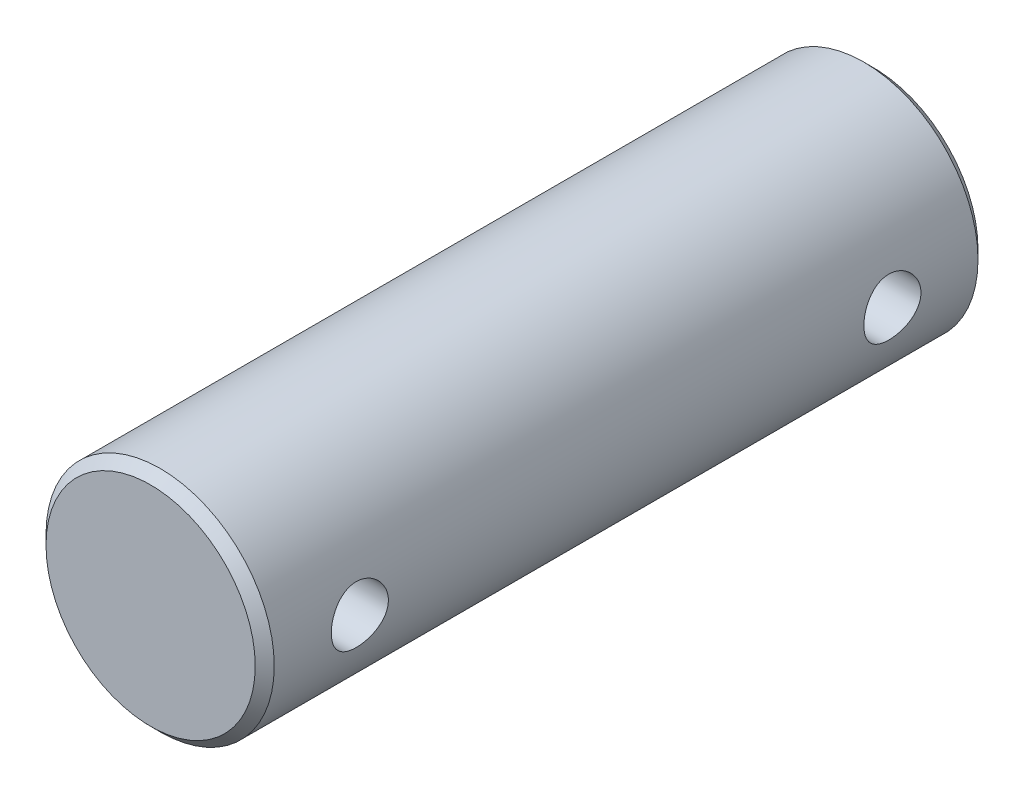
ISO-10303-21;
HEADER;
FILE_DESCRIPTION(('STEP AP214'),'2;1');
FILE_NAME('part.step','',(''),(''),'','','');
FILE_SCHEMA(('AUTOMOTIVE_DESIGN { 1 0 10303 214 1 1 1 1 }'));
ENDSEC;
DATA;
#1=APPLICATION_CONTEXT('core data for automotive mechanical design processes');
#2=APPLICATION_PROTOCOL_DEFINITION('international standard','automotive_design',2000,#1);
#3=PRODUCT_CONTEXT('',#1,'mechanical');
#4=PRODUCT('Part','Part','',(#3));
#5=PRODUCT_RELATED_PRODUCT_CATEGORY('part','',(#4));
#6=PRODUCT_DEFINITION_FORMATION('','',#4);
#7=PRODUCT_DEFINITION_CONTEXT('part definition',#1,'design');
#8=PRODUCT_DEFINITION('design','',#6,#7);
#9=PRODUCT_DEFINITION_SHAPE('','',#8);
#10=(LENGTH_UNIT() NAMED_UNIT(*) SI_UNIT(.MILLI.,.METRE.));
#11=(NAMED_UNIT(*) PLANE_ANGLE_UNIT() SI_UNIT($,.RADIAN.));
#12=(NAMED_UNIT(*) SI_UNIT($,.STERADIAN.) SOLID_ANGLE_UNIT());
#13=UNCERTAINTY_MEASURE_WITH_UNIT(LENGTH_MEASURE(1.E-05),#10,'distance_accuracy_value','');
#14=(GEOMETRIC_REPRESENTATION_CONTEXT(3) GLOBAL_UNCERTAINTY_ASSIGNED_CONTEXT((#13)) GLOBAL_UNIT_ASSIGNED_CONTEXT((#10,
#11,#12)) REPRESENTATION_CONTEXT('',''));
#15=CARTESIAN_POINT('',(0.,0.,0.));
#16=DIRECTION('',(0.,0.,1.));
#17=DIRECTION('',(1.,0.,0.));
#18=AXIS2_PLACEMENT_3D('',#15,#16,#17);
#19=CARTESIAN_POINT('',(0.,0.,19.));
#20=DIRECTION('',(0.,0.,-1.));
#21=DIRECTION('',(-1.,0.,0.));
#22=AXIS2_PLACEMENT_3D('',#19,#20,#21);
#23=CYLINDRICAL_SURFACE('',#22,6.);
#24=CARTESIAN_POINT('',(0.,0.,-18.5));
#25=DIRECTION('',(0.,0.,1.));
#26=DIRECTION('',(1.,0.,0.));
#27=AXIS2_PLACEMENT_3D('',#24,#25,#26);
#28=CIRCLE('',#27,6.);
#29=CARTESIAN_POINT('',(6.,0.,-18.5));
#30=VERTEX_POINT('',#29);
#31=EDGE_CURVE('E71',#30,#30,#28,.T.);
#32=ORIENTED_EDGE('',*,*,#31,.T.);
#33=EDGE_LOOP('',(#32));
#34=FACE_BOUND('',#33,.T.);
#35=CARTESIAN_POINT('',(0.,0.,18.5));
#36=DIRECTION('',(0.,0.,1.));
#37=DIRECTION('',(1.,0.,0.));
#38=AXIS2_PLACEMENT_3D('',#35,#36,#37);
#39=CIRCLE('',#38,6.);
#40=CARTESIAN_POINT('',(6.,0.,18.5));
#41=VERTEX_POINT('',#40);
#42=EDGE_CURVE('E77',#41,#41,#39,.F.);
#43=ORIENTED_EDGE('',*,*,#42,.T.);
#44=EDGE_LOOP('',(#43));
#45=FACE_BOUND('',#44,.T.);
#46=CARTESIAN_POINT('',(-6.,0.,12.5));
#47=CARTESIAN_POINT('',(-5.99999859868013,0.0828760886697312,12.5000023257382));
#48=CARTESIAN_POINT('',(-5.99826578131828,0.165778157830763,12.5068915507738));
#49=CARTESIAN_POINT('',(-5.99152113829892,0.329206323770533,12.534225151307));
#50=CARTESIAN_POINT('',(-5.98650745419968,0.409731046870739,12.5546772095378));
#51=CARTESIAN_POINT('',(-5.9737562633204,0.566020872182577,12.6084392534621));
#52=CARTESIAN_POINT('',(-5.96602202842087,0.641791563430003,12.6417337987153));
#53=CARTESIAN_POINT('',(-5.94865343807593,0.786672131904427,12.7201813900448));
#54=CARTESIAN_POINT('',(-5.9390190185405,0.85578178434876,12.7653348361189));
#55=CARTESIAN_POINT('',(-5.91867413591801,0.98680192730092,12.8672007896542));
#56=CARTESIAN_POINT('',(-5.90794707148533,1.04855569006107,12.9241115749592));
#57=CARTESIAN_POINT('',(-5.8867362011753,1.1617489272033,13.0474522049089));
#58=CARTESIAN_POINT('',(-5.87625242288348,1.21318723694914,13.1138831229465));
#59=CARTESIAN_POINT('',(-5.8565477569971,1.30502654279903,13.2555952267374));
#60=CARTESIAN_POINT('',(-5.84734794470605,1.34525221592536,13.3309932308104));
#61=CARTESIAN_POINT('',(-5.83149494812223,1.41239690855053,13.4877484116584));
#62=CARTESIAN_POINT('',(-5.82484135672789,1.43931805543933,13.5691046333258));
#63=CARTESIAN_POINT('',(-5.81500476717551,1.47855483680429,13.7337434982025));
#64=CARTESIAN_POINT('',(-5.81175491075426,1.49115226833334,13.8169548960498));
#65=CARTESIAN_POINT('',(-5.80889362537741,1.50226177506785,13.984368569014));
#66=CARTESIAN_POINT('',(-5.80928160448644,1.50077614181798,14.0685706806986));
#67=CARTESIAN_POINT('',(-5.81359205496618,1.48398652463928,14.2334158077445));
#68=CARTESIAN_POINT('',(-5.81742863001879,1.46901834019052,14.3140956214651));
#69=CARTESIAN_POINT('',(-5.82806709676484,1.42622418690311,14.4717610509113));
#70=CARTESIAN_POINT('',(-5.83486919970697,1.39839730206942,14.548746403029));
#71=CARTESIAN_POINT('',(-5.85075113904187,1.33038947793715,14.6977380162521));
#72=CARTESIAN_POINT('',(-5.85985327469421,1.29008666723291,14.7696861717896));
#73=CARTESIAN_POINT('',(-5.87929710846386,1.19835627601495,14.9059187097568));
#74=CARTESIAN_POINT('',(-5.88963902334735,1.14692674880884,14.9702017480673));
#75=CARTESIAN_POINT('',(-5.91075880539781,1.03266342468122,15.0912036156944));
#76=CARTESIAN_POINT('',(-5.92154069477971,0.969546258165858,15.1476544900613));
#77=CARTESIAN_POINT('',(-5.94205965578786,0.834611917503699,15.2492212424639));
#78=CARTESIAN_POINT('',(-5.95179669549415,0.762794477707943,15.2943367742636));
#79=CARTESIAN_POINT('',(-5.96917732094183,0.612115888681391,15.3720505862244));
#80=CARTESIAN_POINT('',(-5.97681360127725,0.533231393208623,15.4046053402544));
#81=CARTESIAN_POINT('',(-5.98907916991419,0.370876008142882,15.4559173057096));
#82=CARTESIAN_POINT('',(-5.99370903339281,0.287405999150484,15.4746771564181));
#83=CARTESIAN_POINT('',(-5.99935499271375,0.120539970390027,15.4974575655588));
#84=CARTESIAN_POINT('',(-6.00046053508279,0.0371967199882093,15.5018430260753));
#85=CARTESIAN_POINT('',(-5.99918804814451,-0.129032874801509,15.4967509979445));
#86=CARTESIAN_POINT('',(-5.99681033241847,-0.211919259644596,15.4872747572009));
#87=CARTESIAN_POINT('',(-5.98889581127357,-0.373614268776493,15.4550290916086));
#88=CARTESIAN_POINT('',(-5.98340634185811,-0.452465118968756,15.432458736523));
#89=CARTESIAN_POINT('',(-5.96988706634134,-0.605257292452512,15.3748929159716));
#90=CARTESIAN_POINT('',(-5.96185700369892,-0.679198119032635,15.3398961956868));
#91=CARTESIAN_POINT('',(-5.9439330792631,-0.821523134429848,15.2577638711253));
#92=CARTESIAN_POINT('',(-5.93400867366932,-0.889785441835831,15.2104238876032));
#93=CARTESIAN_POINT('',(-5.91344509187419,-1.01752661364325,15.105210091203));
#94=CARTESIAN_POINT('',(-5.90280579251705,-1.07700395897301,15.0473344603831));
#95=CARTESIAN_POINT('',(-5.88168956960771,-1.18699056807273,14.9209980391555));
#96=CARTESIAN_POINT('',(-5.87122304187281,-1.23724386762203,14.8523122969976));
#97=CARTESIAN_POINT('',(-5.85192878377239,-1.3255107590127,14.7072673655343));
#98=CARTESIAN_POINT('',(-5.84310098067026,-1.36352489415794,14.6309085170402));
#99=CARTESIAN_POINT('',(-5.82818094734665,-1.42595142060929,14.4730942775869));
#100=CARTESIAN_POINT('',(-5.82207255291906,-1.45044439665407,14.391672371656));
#101=CARTESIAN_POINT('',(-5.81326744090184,-1.48534565995378,14.2256903621109));
#102=CARTESIAN_POINT('',(-5.81056997719936,-1.49575702747866,14.1411309489675));
#103=CARTESIAN_POINT('',(-5.80894901203957,-1.50203859033399,13.9738789761448));
#104=CARTESIAN_POINT('',(-5.80991932728264,-1.49831789778012,13.8912025648753));
#105=CARTESIAN_POINT('',(-5.81527909007843,-1.47737727831287,13.727696111332));
#106=CARTESIAN_POINT('',(-5.81966846891857,-1.46015762268677,13.6468660319863));
#107=CARTESIAN_POINT('',(-5.83131260682723,-1.41293131944279,13.4897915409346));
#108=CARTESIAN_POINT('',(-5.8385501523631,-1.38300140468038,13.4135226947598));
#109=CARTESIAN_POINT('',(-5.85507755724829,-1.31126491360507,13.2670346172863));
#110=CARTESIAN_POINT('',(-5.86436770120773,-1.26945669003419,13.1968162268131));
#111=CARTESIAN_POINT('',(-5.88425634263512,-1.17386774863714,13.062445370998));
#112=CARTESIAN_POINT('',(-5.89488264831757,-1.11980316291225,12.998498926576));
#113=CARTESIAN_POINT('',(-5.91608027246286,-1.00178937118973,12.8804529552046));
#114=CARTESIAN_POINT('',(-5.9266515772706,-0.937837821261145,12.826355769887));
#115=CARTESIAN_POINT('',(-5.94677655647663,-0.80046758670259,12.7285886914354));
#116=CARTESIAN_POINT('',(-5.95630833365868,-0.726898422316387,12.6851253863284));
#117=CARTESIAN_POINT('',(-5.97304924975118,-0.573266059510476,12.6112525370595));
#118=CARTESIAN_POINT('',(-5.98026005199781,-0.493207563436739,12.5808336393515));
#119=CARTESIAN_POINT('',(-5.99048059565542,-0.344410253243471,12.5384281696703));
#120=CARTESIAN_POINT('',(-5.99402585052691,-0.276380170908068,12.5240487569466));
#121=CARTESIAN_POINT('',(-5.99878605231948,-0.138906071536283,12.5048340563781));
#122=CARTESIAN_POINT('',(-6.00000117450894,-0.0694621612426163,12.4999980506947));
#123=CARTESIAN_POINT('',(-6.,0.,12.5));
#124=B_SPLINE_CURVE_WITH_KNOTS('',3,(#46,#47,#48,#49,#50,#51,#52,#53,#54,#55,#56,#57,#58,#59,
#60,#61,#62,#63,#64,#65,#66,#67,#68,#69,#70,#71,#72,#73,#74,#75,#76,#77,#78,#79,#80,#81,#82,#83,
#84,#85,#86,#87,#88,#89,#90,#91,#92,#93,#94,#95,#96,#97,#98,#99,#100,#101,#102,#103,#104,#105,
#106,#107,#108,#109,#110,#111,#112,#113,#114,#115,#116,#117,#118,#119,#120,#121,#122,#123),
.UNSPECIFIED.,.T.,.F.,(4,2,2,2,2,2,2,2,2,2,2,2,2,2,2,2,2,2,2,2,2,2,2,2,2,2,2,2,2,2,2,2,2,2,2,2,
2,2,4),(0.,0.24837371247189,0.4968882377639,0.745104902286106,0.993329940169329,
1.24614435437139,1.49898729580062,1.75558647545807,2.01214461169368,2.26356295099431,
2.51494038112697,2.76022497007018,3.00552703466038,3.25330527873879,3.50112690836163,
3.75601500969019,4.01091089558247,4.26668229009114,4.52240473688643,4.77158308949276,
5.02073901112743,5.26620274514038,5.51169127322291,5.76153587565352,6.01142363008019,
6.26744509204476,6.52345518749508,6.77792254614037,7.03233423252408,7.27943780398613,
7.52653640956035,7.77216400559448,8.01782568136902,8.26989576409911,8.52202569770418,
8.77872185499588,9.0352336382135,9.24342242942149,9.4515955604304),.UNSPECIFIED.);
#125=CARTESIAN_POINT('',(-6.,0.,12.5));
#126=VERTEX_POINT('',#125);
#127=EDGE_CURVE('E83',#126,#126,#124,.T.);
#128=ORIENTED_EDGE('',*,*,#127,.T.);
#129=EDGE_LOOP('',(#128));
#130=FACE_BOUND('',#129,.T.);
#131=CARTESIAN_POINT('',(6.,0.,12.5));
#132=CARTESIAN_POINT('',(5.99999859868012,-0.0828760886697312,12.5000023257382));
#133=CARTESIAN_POINT('',(5.99826578131828,-0.165778157830763,12.5068915507738));
#134=CARTESIAN_POINT('',(5.99152113829892,-0.329206323770533,12.534225151307));
#135=CARTESIAN_POINT('',(5.98650745419968,-0.40973104687074,12.5546772095378));
#136=CARTESIAN_POINT('',(5.9737562633204,-0.566020872182577,12.6084392534621));
#137=CARTESIAN_POINT('',(5.96602202842087,-0.641791563430003,12.6417337987153));
#138=CARTESIAN_POINT('',(5.94865343807593,-0.786672131904427,12.7201813900448));
#139=CARTESIAN_POINT('',(5.9390190185405,-0.85578178434876,12.7653348361189));
#140=CARTESIAN_POINT('',(5.91867413591801,-0.986801927300921,12.8672007896542));
#141=CARTESIAN_POINT('',(5.90794707148533,-1.04855569006107,12.9241115749592));
#142=CARTESIAN_POINT('',(5.8867362011753,-1.16174892720331,13.0474522049089));
#143=CARTESIAN_POINT('',(5.87625242288348,-1.21318723694914,13.1138831229465));
#144=CARTESIAN_POINT('',(5.8565477569971,-1.30502654279903,13.2555952267374));
#145=CARTESIAN_POINT('',(5.84734794470605,-1.34525221592536,13.3309932308104));
#146=CARTESIAN_POINT('',(5.83149494812223,-1.41239690855053,13.4877484116584));
#147=CARTESIAN_POINT('',(5.82484135672789,-1.43931805543933,13.5691046333258));
#148=CARTESIAN_POINT('',(5.81500476717551,-1.47855483680429,13.7337434982025));
#149=CARTESIAN_POINT('',(5.81175491075426,-1.49115226833334,13.8169548960498));
#150=CARTESIAN_POINT('',(5.80889362537741,-1.50226177506785,13.984368569014));
#151=CARTESIAN_POINT('',(5.80928160448644,-1.50077614181798,14.0685706806986));
#152=CARTESIAN_POINT('',(5.81359205496618,-1.48398652463928,14.2334158077445));
#153=CARTESIAN_POINT('',(5.81742863001879,-1.46901834019052,14.3140956214651));
#154=CARTESIAN_POINT('',(5.82806709676484,-1.42622418690311,14.4717610509113));
#155=CARTESIAN_POINT('',(5.83486919970696,-1.39839730206942,14.548746403029));
#156=CARTESIAN_POINT('',(5.85075113904187,-1.33038947793715,14.6977380162521));
#157=CARTESIAN_POINT('',(5.85985327469421,-1.29008666723291,14.7696861717896));
#158=CARTESIAN_POINT('',(5.87929710846386,-1.19835627601495,14.9059187097568));
#159=CARTESIAN_POINT('',(5.88963902334735,-1.14692674880884,14.9702017480673));
#160=CARTESIAN_POINT('',(5.91075880539781,-1.03266342468122,15.0912036156944));
#161=CARTESIAN_POINT('',(5.92154069477971,-0.969546258165859,15.1476544900613));
#162=CARTESIAN_POINT('',(5.94205965578786,-0.8346119175037,15.2492212424639));
#163=CARTESIAN_POINT('',(5.95179669549415,-0.762794477707944,15.2943367742636));
#164=CARTESIAN_POINT('',(5.96917732094183,-0.612115888681392,15.3720505862244));
#165=CARTESIAN_POINT('',(5.97681360127725,-0.533231393208623,15.4046053402544));
#166=CARTESIAN_POINT('',(5.98907916991419,-0.370876008142882,15.4559173057096));
#167=CARTESIAN_POINT('',(5.99370903339281,-0.287405999150484,15.4746771564181));
#168=CARTESIAN_POINT('',(5.99935499271375,-0.120539970390026,15.4974575655588));
#169=CARTESIAN_POINT('',(6.00046053508279,-0.037196719988209,15.5018430260753));
#170=CARTESIAN_POINT('',(5.99918804814451,0.129032874801509,15.4967509979445));
#171=CARTESIAN_POINT('',(5.99681033241847,0.211919259644596,15.4872747572009));
#172=CARTESIAN_POINT('',(5.98889581127357,0.373614268776493,15.4550290916086));
#173=CARTESIAN_POINT('',(5.98340634185811,0.452465118968756,15.432458736523));
#174=CARTESIAN_POINT('',(5.96988706634134,0.605257292452513,15.3748929159716));
#175=CARTESIAN_POINT('',(5.96185700369892,0.679198119032636,15.3398961956868));
#176=CARTESIAN_POINT('',(5.9439330792631,0.821523134429849,15.2577638711253));
#177=CARTESIAN_POINT('',(5.93400867366932,0.889785441835832,15.2104238876032));
#178=CARTESIAN_POINT('',(5.91344509187419,1.01752661364325,15.105210091203));
#179=CARTESIAN_POINT('',(5.90280579251705,1.07700395897301,15.0473344603831));
#180=CARTESIAN_POINT('',(5.88168956960771,1.18699056807273,14.9209980391555));
#181=CARTESIAN_POINT('',(5.87122304187281,1.23724386762203,14.8523122969976));
#182=CARTESIAN_POINT('',(5.85192878377239,1.3255107590127,14.7072673655343));
#183=CARTESIAN_POINT('',(5.84310098067026,1.36352489415794,14.6309085170402));
#184=CARTESIAN_POINT('',(5.82818094734665,1.42595142060929,14.4730942775869));
#185=CARTESIAN_POINT('',(5.82207255291906,1.45044439665407,14.391672371656));
#186=CARTESIAN_POINT('',(5.81326744090184,1.48534565995378,14.2256903621109));
#187=CARTESIAN_POINT('',(5.81056997719936,1.49575702747866,14.1411309489675));
#188=CARTESIAN_POINT('',(5.80894901203957,1.50203859033399,13.9738789761448));
#189=CARTESIAN_POINT('',(5.80991932728264,1.49831789778012,13.8912025648753));
#190=CARTESIAN_POINT('',(5.81527909007843,1.47737727831287,13.727696111332));
#191=CARTESIAN_POINT('',(5.81966846891857,1.46015762268677,13.6468660319863));
#192=CARTESIAN_POINT('',(5.83131260682723,1.41293131944279,13.4897915409346));
#193=CARTESIAN_POINT('',(5.8385501523631,1.38300140468038,13.4135226947598));
#194=CARTESIAN_POINT('',(5.85507755724829,1.31126491360507,13.2670346172863));
#195=CARTESIAN_POINT('',(5.86436770120773,1.26945669003419,13.1968162268131));
#196=CARTESIAN_POINT('',(5.88425634263512,1.17386774863714,13.062445370998));
#197=CARTESIAN_POINT('',(5.89488264831757,1.11980316291225,12.998498926576));
#198=CARTESIAN_POINT('',(5.91608027246286,1.00178937118973,12.8804529552046));
#199=CARTESIAN_POINT('',(5.9266515772706,0.937837821261145,12.826355769887));
#200=CARTESIAN_POINT('',(5.94677655647663,0.800467586702589,12.7285886914354));
#201=CARTESIAN_POINT('',(5.95630833365868,0.726898422316386,12.6851253863284));
#202=CARTESIAN_POINT('',(5.97304924975118,0.573266059510475,12.6112525370595));
#203=CARTESIAN_POINT('',(5.98026005199781,0.493207563436738,12.5808336393515));
#204=CARTESIAN_POINT('',(5.99048059565542,0.344410253243471,12.5384281696703));
#205=CARTESIAN_POINT('',(5.99402585052691,0.276380170908068,12.5240487569466));
#206=CARTESIAN_POINT('',(5.99878605231948,0.138906071536283,12.5048340563781));
#207=CARTESIAN_POINT('',(6.00000117450894,0.0694621612426163,12.4999980506947));
#208=CARTESIAN_POINT('',(6.,0.,12.5));
#209=B_SPLINE_CURVE_WITH_KNOTS('',3,(#131,#132,#133,#134,#135,#136,#137,#138,#139,#140,#141,
#142,#143,#144,#145,#146,#147,#148,#149,#150,#151,#152,#153,#154,#155,#156,#157,#158,#159,#160,
#161,#162,#163,#164,#165,#166,#167,#168,#169,#170,#171,#172,#173,#174,#175,#176,#177,#178,#179,
#180,#181,#182,#183,#184,#185,#186,#187,#188,#189,#190,#191,#192,#193,#194,#195,#196,#197,#198,
#199,#200,#201,#202,#203,#204,#205,#206,#207,#208),.UNSPECIFIED.,.T.,.F.,(4,2,2,2,2,2,2,2,2,2,2,
2,2,2,2,2,2,2,2,2,2,2,2,2,2,2,2,2,2,2,2,2,2,2,2,2,2,2,4),(0.,0.24837371247189,0.4968882377639,
0.745104902286106,0.993329940169329,1.24614435437139,1.49898729580062,1.75558647545807,
2.01214461169368,2.26356295099431,2.51494038112697,2.76022497007018,3.00552703466038,
3.25330527873879,3.50112690836163,3.75601500969019,4.01091089558247,4.26668229009114,
4.52240473688643,4.77158308949276,5.02073901112743,5.26620274514038,5.51169127322291,
5.76153587565352,6.01142363008019,6.26744509204476,6.52345518749508,6.77792254614037,
7.03233423252408,7.27943780398613,7.52653640956035,7.77216400559448,8.01782568136901,
8.2698957640991,8.52202569770418,8.77872185499588,9.0352336382135,9.24342242942149,
9.4515955604304),.UNSPECIFIED.);
#210=CARTESIAN_POINT('',(6.,0.,12.5));
#211=VERTEX_POINT('',#210);
#212=EDGE_CURVE('E92',#211,#211,#209,.T.);
#213=ORIENTED_EDGE('',*,*,#212,.T.);
#214=EDGE_LOOP('',(#213));
#215=FACE_BOUND('',#214,.T.);
#216=CARTESIAN_POINT('',(-6.,0.,-15.5));
#217=CARTESIAN_POINT('',(-5.99999859868013,0.0828760886697312,-15.4999976742618));
#218=CARTESIAN_POINT('',(-5.99826578131828,0.165778157830763,-15.4931084492262));
#219=CARTESIAN_POINT('',(-5.99152113829892,0.329206323770533,-15.465774848693));
#220=CARTESIAN_POINT('',(-5.98650745419968,0.409731046870739,-15.4453227904621));
#221=CARTESIAN_POINT('',(-5.9737562633204,0.566020872182577,-15.3915607465379));
#222=CARTESIAN_POINT('',(-5.96602202842087,0.641791563430003,-15.3582662012847));
#223=CARTESIAN_POINT('',(-5.94865343807593,0.786672131904427,-15.2798186099552));
#224=CARTESIAN_POINT('',(-5.9390190185405,0.85578178434876,-15.2346651638811));
#225=CARTESIAN_POINT('',(-5.91867413591801,0.98680192730092,-15.1327992103458));
#226=CARTESIAN_POINT('',(-5.90794707148533,1.04855569006107,-15.0758884250408));
#227=CARTESIAN_POINT('',(-5.8867362011753,1.1617489272033,-14.9525477950911));
#228=CARTESIAN_POINT('',(-5.87625242288348,1.21318723694914,-14.8861168770535));
#229=CARTESIAN_POINT('',(-5.8565477569971,1.30502654279903,-14.7444047732626));
#230=CARTESIAN_POINT('',(-5.84734794470605,1.34525221592536,-14.6690067691896));
#231=CARTESIAN_POINT('',(-5.83149494812223,1.41239690855053,-14.5122515883416));
#232=CARTESIAN_POINT('',(-5.82484135672789,1.43931805543933,-14.4308953666742));
#233=CARTESIAN_POINT('',(-5.81500476717551,1.47855483680429,-14.2662565017975));
#234=CARTESIAN_POINT('',(-5.81175491075426,1.49115226833334,-14.1830451039502));
#235=CARTESIAN_POINT('',(-5.80889362537741,1.50226177506785,-14.015631430986));
#236=CARTESIAN_POINT('',(-5.80928160448644,1.50077614181798,-13.9314293193014));
#237=CARTESIAN_POINT('',(-5.81359205496618,1.48398652463928,-13.7665841922555));
#238=CARTESIAN_POINT('',(-5.81742863001879,1.46901834019052,-13.6859043785349));
#239=CARTESIAN_POINT('',(-5.82806709676484,1.42622418690311,-13.5282389490887));
#240=CARTESIAN_POINT('',(-5.83486919970697,1.39839730206942,-13.451253596971));
#241=CARTESIAN_POINT('',(-5.85075113904187,1.33038947793715,-13.3022619837479));
#242=CARTESIAN_POINT('',(-5.85985327469421,1.29008666723291,-13.2303138282104));
#243=CARTESIAN_POINT('',(-5.87929710846386,1.19835627601495,-13.0940812902432));
#244=CARTESIAN_POINT('',(-5.88963902334735,1.14692674880884,-13.0297982519327));
#245=CARTESIAN_POINT('',(-5.91075880539781,1.03266342468122,-12.9087963843056));
#246=CARTESIAN_POINT('',(-5.92154069477971,0.969546258165858,-12.8523455099386));
#247=CARTESIAN_POINT('',(-5.94205965578786,0.834611917503699,-12.7507787575361));
#248=CARTESIAN_POINT('',(-5.95179669549415,0.762794477707943,-12.7056632257364));
#249=CARTESIAN_POINT('',(-5.96917732094183,0.612115888681391,-12.6279494137756));
#250=CARTESIAN_POINT('',(-5.97681360127725,0.533231393208623,-12.5953946597456));
#251=CARTESIAN_POINT('',(-5.98907916991419,0.370876008142882,-12.5440826942904));
#252=CARTESIAN_POINT('',(-5.99370903339281,0.287405999150484,-12.5253228435819));
#253=CARTESIAN_POINT('',(-5.99935499271375,0.120539970390027,-12.5025424344412));
#254=CARTESIAN_POINT('',(-6.00046053508279,0.0371967199882093,-12.4981569739247));
#255=CARTESIAN_POINT('',(-5.99918804814451,-0.129032874801509,-12.5032490020555));
#256=CARTESIAN_POINT('',(-5.99681033241847,-0.211919259644596,-12.5127252427991));
#257=CARTESIAN_POINT('',(-5.98889581127357,-0.373614268776493,-12.5449709083914));
#258=CARTESIAN_POINT('',(-5.98340634185811,-0.452465118968755,-12.567541263477));
#259=CARTESIAN_POINT('',(-5.96988706634134,-0.605257292452512,-12.6251070840284));
#260=CARTESIAN_POINT('',(-5.96185700369892,-0.679198119032635,-12.6601038043132));
#261=CARTESIAN_POINT('',(-5.9439330792631,-0.821523134429848,-12.7422361288747));
#262=CARTESIAN_POINT('',(-5.93400867366932,-0.889785441835831,-12.7895761123968));
#263=CARTESIAN_POINT('',(-5.91344509187419,-1.01752661364325,-12.894789908797));
#264=CARTESIAN_POINT('',(-5.90280579251705,-1.07700395897301,-12.9526655396169));
#265=CARTESIAN_POINT('',(-5.88168956960771,-1.18699056807273,-13.0790019608445));
#266=CARTESIAN_POINT('',(-5.87122304187281,-1.23724386762203,-13.1476877030024));
#267=CARTESIAN_POINT('',(-5.85192878377239,-1.3255107590127,-13.2927326344657));
#268=CARTESIAN_POINT('',(-5.84310098067026,-1.36352489415794,-13.3690914829597));
#269=CARTESIAN_POINT('',(-5.82818094734665,-1.42595142060929,-13.5269057224131));
#270=CARTESIAN_POINT('',(-5.82207255291906,-1.45044439665407,-13.608327628344));
#271=CARTESIAN_POINT('',(-5.81326744090184,-1.48534565995378,-13.7743096378891));
#272=CARTESIAN_POINT('',(-5.81056997719936,-1.49575702747866,-13.8588690510325));
#273=CARTESIAN_POINT('',(-5.80894901203957,-1.50203859033399,-14.0261210238552));
#274=CARTESIAN_POINT('',(-5.80991932728264,-1.49831789778012,-14.1087974351247));
#275=CARTESIAN_POINT('',(-5.81527909007843,-1.47737727831287,-14.272303888668));
#276=CARTESIAN_POINT('',(-5.81966846891857,-1.46015762268677,-14.3531339680136));
#277=CARTESIAN_POINT('',(-5.83131260682723,-1.41293131944279,-14.5102084590654));
#278=CARTESIAN_POINT('',(-5.83855015236309,-1.38300140468038,-14.5864773052402));
#279=CARTESIAN_POINT('',(-5.85507755724829,-1.31126491360507,-14.7329653827137));
#280=CARTESIAN_POINT('',(-5.86436770120773,-1.26945669003419,-14.8031837731869));
#281=CARTESIAN_POINT('',(-5.88425634263512,-1.17386774863714,-14.937554629002));
#282=CARTESIAN_POINT('',(-5.89488264831757,-1.11980316291225,-15.001501073424));
#283=CARTESIAN_POINT('',(-5.91608027246286,-1.00178937118973,-15.1195470447954));
#284=CARTESIAN_POINT('',(-5.9266515772706,-0.937837821261145,-15.173644230113));
#285=CARTESIAN_POINT('',(-5.94677655647663,-0.80046758670259,-15.2714113085646));
#286=CARTESIAN_POINT('',(-5.95630833365868,-0.726898422316387,-15.3148746136716));
#287=CARTESIAN_POINT('',(-5.97304924975118,-0.573266059510476,-15.3887474629405));
#288=CARTESIAN_POINT('',(-5.98026005199781,-0.493207563436739,-15.4191663606485));
#289=CARTESIAN_POINT('',(-5.99048059565542,-0.344410253243471,-15.4615718303297));
#290=CARTESIAN_POINT('',(-5.99402585052691,-0.276380170908068,-15.4759512430534));
#291=CARTESIAN_POINT('',(-5.99878605231948,-0.138906071536283,-15.4951659436219));
#292=CARTESIAN_POINT('',(-6.00000117450894,-0.0694621612426163,-15.5000019493053));
#293=CARTESIAN_POINT('',(-6.,0.,-15.5));
#294=B_SPLINE_CURVE_WITH_KNOTS('',3,(#216,#217,#218,#219,#220,#221,#222,#223,#224,#225,#226,
#227,#228,#229,#230,#231,#232,#233,#234,#235,#236,#237,#238,#239,#240,#241,#242,#243,#244,#245,
#246,#247,#248,#249,#250,#251,#252,#253,#254,#255,#256,#257,#258,#259,#260,#261,#262,#263,#264,
#265,#266,#267,#268,#269,#270,#271,#272,#273,#274,#275,#276,#277,#278,#279,#280,#281,#282,#283,
#284,#285,#286,#287,#288,#289,#290,#291,#292,#293),.UNSPECIFIED.,.T.,.F.,(4,2,2,2,2,2,2,2,2,2,2,
2,2,2,2,2,2,2,2,2,2,2,2,2,2,2,2,2,2,2,2,2,2,2,2,2,2,2,4),(0.,0.24837371247189,0.4968882377639,
0.745104902286106,0.993329940169329,1.24614435437139,1.49898729580062,1.75558647545807,
2.01214461169368,2.26356295099431,2.51494038112697,2.76022497007018,3.00552703466038,
3.25330527873879,3.50112690836163,3.7560150096902,4.01091089558247,4.26668229009114,
4.52240473688643,4.77158308949276,5.02073901112743,5.26620274514038,5.51169127322291,
5.76153587565352,6.01142363008019,6.26744509204476,6.52345518749508,6.77792254614037,
7.03233423252408,7.27943780398613,7.52653640956035,7.77216400559448,8.01782568136902,
8.26989576409911,8.52202569770418,8.77872185499588,9.0352336382135,9.24342242942149,
9.4515955604304),.UNSPECIFIED.);
#295=CARTESIAN_POINT('',(-6.,0.,-15.5));
#296=VERTEX_POINT('',#295);
#297=EDGE_CURVE('E119',#296,#296,#294,.T.);
#298=ORIENTED_EDGE('',*,*,#297,.T.);
#299=EDGE_LOOP('',(#298));
#300=FACE_BOUND('',#299,.T.);
#301=CARTESIAN_POINT('',(6.,0.,-15.5));
#302=CARTESIAN_POINT('',(5.99999859868012,-0.0828760886697312,-15.4999976742618));
#303=CARTESIAN_POINT('',(5.99826578131828,-0.165778157830763,-15.4931084492262));
#304=CARTESIAN_POINT('',(5.99152113829892,-0.329206323770533,-15.465774848693));
#305=CARTESIAN_POINT('',(5.98650745419968,-0.40973104687074,-15.4453227904621));
#306=CARTESIAN_POINT('',(5.9737562633204,-0.566020872182577,-15.3915607465379));
#307=CARTESIAN_POINT('',(5.96602202842087,-0.641791563430003,-15.3582662012847));
#308=CARTESIAN_POINT('',(5.94865343807593,-0.786672131904427,-15.2798186099552));
#309=CARTESIAN_POINT('',(5.9390190185405,-0.85578178434876,-15.2346651638811));
#310=CARTESIAN_POINT('',(5.91867413591801,-0.986801927300921,-15.1327992103458));
#311=CARTESIAN_POINT('',(5.90794707148533,-1.04855569006107,-15.0758884250408));
#312=CARTESIAN_POINT('',(5.88673620117529,-1.16174892720331,-14.9525477950911));
#313=CARTESIAN_POINT('',(5.87625242288348,-1.21318723694914,-14.8861168770535));
#314=CARTESIAN_POINT('',(5.8565477569971,-1.30502654279903,-14.7444047732626));
#315=CARTESIAN_POINT('',(5.84734794470605,-1.34525221592536,-14.6690067691896));
#316=CARTESIAN_POINT('',(5.83149494812223,-1.41239690855053,-14.5122515883416));
#317=CARTESIAN_POINT('',(5.82484135672789,-1.43931805543933,-14.4308953666742));
#318=CARTESIAN_POINT('',(5.81500476717551,-1.47855483680429,-14.2662565017975));
#319=CARTESIAN_POINT('',(5.81175491075426,-1.49115226833334,-14.1830451039502));
#320=CARTESIAN_POINT('',(5.80889362537741,-1.50226177506785,-14.015631430986));
#321=CARTESIAN_POINT('',(5.80928160448644,-1.50077614181798,-13.9314293193014));
#322=CARTESIAN_POINT('',(5.81359205496618,-1.48398652463928,-13.7665841922555));
#323=CARTESIAN_POINT('',(5.81742863001879,-1.46901834019052,-13.6859043785349));
#324=CARTESIAN_POINT('',(5.82806709676484,-1.42622418690311,-13.5282389490887));
#325=CARTESIAN_POINT('',(5.83486919970696,-1.39839730206942,-13.451253596971));
#326=CARTESIAN_POINT('',(5.85075113904187,-1.33038947793715,-13.3022619837479));
#327=CARTESIAN_POINT('',(5.85985327469421,-1.29008666723291,-13.2303138282104));
#328=CARTESIAN_POINT('',(5.87929710846386,-1.19835627601495,-13.0940812902432));
#329=CARTESIAN_POINT('',(5.88963902334735,-1.14692674880884,-13.0297982519327));
#330=CARTESIAN_POINT('',(5.91075880539781,-1.03266342468122,-12.9087963843056));
#331=CARTESIAN_POINT('',(5.92154069477971,-0.969546258165859,-12.8523455099386));
#332=CARTESIAN_POINT('',(5.94205965578786,-0.8346119175037,-12.7507787575361));
#333=CARTESIAN_POINT('',(5.95179669549415,-0.762794477707944,-12.7056632257364));
#334=CARTESIAN_POINT('',(5.96917732094183,-0.612115888681392,-12.6279494137756));
#335=CARTESIAN_POINT('',(5.97681360127725,-0.533231393208623,-12.5953946597456));
#336=CARTESIAN_POINT('',(5.98907916991419,-0.370876008142882,-12.5440826942904));
#337=CARTESIAN_POINT('',(5.99370903339281,-0.287405999150484,-12.5253228435819));
#338=CARTESIAN_POINT('',(5.99935499271375,-0.120539970390026,-12.5025424344412));
#339=CARTESIAN_POINT('',(6.00046053508279,-0.0371967199882091,-12.4981569739247));
#340=CARTESIAN_POINT('',(5.99918804814451,0.129032874801509,-12.5032490020555));
#341=CARTESIAN_POINT('',(5.99681033241847,0.211919259644596,-12.5127252427991));
#342=CARTESIAN_POINT('',(5.98889581127357,0.373614268776493,-12.5449709083914));
#343=CARTESIAN_POINT('',(5.98340634185811,0.452465118968756,-12.567541263477));
#344=CARTESIAN_POINT('',(5.96988706634134,0.605257292452513,-12.6251070840284));
#345=CARTESIAN_POINT('',(5.96185700369892,0.679198119032636,-12.6601038043132));
#346=CARTESIAN_POINT('',(5.9439330792631,0.821523134429849,-12.7422361288747));
#347=CARTESIAN_POINT('',(5.93400867366932,0.889785441835832,-12.7895761123968));
#348=CARTESIAN_POINT('',(5.91344509187419,1.01752661364325,-12.894789908797));
#349=CARTESIAN_POINT('',(5.90280579251705,1.07700395897301,-12.9526655396169));
#350=CARTESIAN_POINT('',(5.88168956960771,1.18699056807273,-13.0790019608445));
#351=CARTESIAN_POINT('',(5.87122304187281,1.23724386762203,-13.1476877030024));
#352=CARTESIAN_POINT('',(5.85192878377239,1.3255107590127,-13.2927326344657));
#353=CARTESIAN_POINT('',(5.84310098067026,1.36352489415794,-13.3690914829598));
#354=CARTESIAN_POINT('',(5.82818094734665,1.42595142060929,-13.5269057224131));
#355=CARTESIAN_POINT('',(5.82207255291906,1.45044439665407,-13.608327628344));
#356=CARTESIAN_POINT('',(5.81326744090184,1.48534565995378,-13.7743096378891));
#357=CARTESIAN_POINT('',(5.81056997719936,1.49575702747866,-13.8588690510325));
#358=CARTESIAN_POINT('',(5.80894901203957,1.50203859033399,-14.0261210238552));
#359=CARTESIAN_POINT('',(5.80991932728264,1.49831789778012,-14.1087974351247));
#360=CARTESIAN_POINT('',(5.81527909007843,1.47737727831287,-14.272303888668));
#361=CARTESIAN_POINT('',(5.81966846891857,1.46015762268677,-14.3531339680137));
#362=CARTESIAN_POINT('',(5.83131260682723,1.41293131944279,-14.5102084590654));
#363=CARTESIAN_POINT('',(5.83855015236309,1.38300140468038,-14.5864773052402));
#364=CARTESIAN_POINT('',(5.85507755724829,1.31126491360507,-14.7329653827137));
#365=CARTESIAN_POINT('',(5.86436770120773,1.26945669003419,-14.8031837731869));
#366=CARTESIAN_POINT('',(5.88425634263512,1.17386774863714,-14.937554629002));
#367=CARTESIAN_POINT('',(5.89488264831757,1.11980316291225,-15.001501073424));
#368=CARTESIAN_POINT('',(5.91608027246286,1.00178937118973,-15.1195470447954));
#369=CARTESIAN_POINT('',(5.9266515772706,0.937837821261145,-15.173644230113));
#370=CARTESIAN_POINT('',(5.94677655647663,0.800467586702589,-15.2714113085646));
#371=CARTESIAN_POINT('',(5.95630833365868,0.726898422316385,-15.3148746136716));
#372=CARTESIAN_POINT('',(5.97304924975118,0.573266059510474,-15.3887474629405));
#373=CARTESIAN_POINT('',(5.98026005199781,0.493207563436738,-15.4191663606485));
#374=CARTESIAN_POINT('',(5.99048059565542,0.344410253243471,-15.4615718303297));
#375=CARTESIAN_POINT('',(5.99402585052691,0.276380170908068,-15.4759512430534));
#376=CARTESIAN_POINT('',(5.99878605231948,0.138906071536283,-15.4951659436219));
#377=CARTESIAN_POINT('',(6.00000117450894,0.0694621612426163,-15.5000019493053));
#378=CARTESIAN_POINT('',(6.,0.,-15.5));
#379=B_SPLINE_CURVE_WITH_KNOTS('',3,(#301,#302,#303,#304,#305,#306,#307,#308,#309,#310,#311,
#312,#313,#314,#315,#316,#317,#318,#319,#320,#321,#322,#323,#324,#325,#326,#327,#328,#329,#330,
#331,#332,#333,#334,#335,#336,#337,#338,#339,#340,#341,#342,#343,#344,#345,#346,#347,#348,#349,
#350,#351,#352,#353,#354,#355,#356,#357,#358,#359,#360,#361,#362,#363,#364,#365,#366,#367,#368,
#369,#370,#371,#372,#373,#374,#375,#376,#377,#378),.UNSPECIFIED.,.T.,.F.,(4,2,2,2,2,2,2,2,2,2,2,
2,2,2,2,2,2,2,2,2,2,2,2,2,2,2,2,2,2,2,2,2,2,2,2,2,2,2,4),(0.,0.24837371247189,0.4968882377639,
0.745104902286106,0.993329940169329,1.24614435437139,1.49898729580062,1.75558647545807,
2.01214461169368,2.26356295099431,2.51494038112697,2.76022497007018,3.00552703466038,
3.25330527873879,3.50112690836163,3.75601500969019,4.01091089558247,4.26668229009114,
4.52240473688643,4.77158308949276,5.02073901112743,5.26620274514038,5.51169127322291,
5.76153587565352,6.01142363008019,6.26744509204476,6.52345518749508,6.77792254614037,
7.03233423252408,7.27943780398613,7.52653640956035,7.77216400559447,8.01782568136902,
8.26989576409911,8.52202569770418,8.77872185499588,9.0352336382135,9.24342242942149,
9.4515955604304),.UNSPECIFIED.);
#380=CARTESIAN_POINT('',(6.,0.,-15.5));
#381=VERTEX_POINT('',#380);
#382=EDGE_CURVE('E115',#381,#381,#379,.T.);
#383=ORIENTED_EDGE('',*,*,#382,.T.);
#384=EDGE_LOOP('',(#383));
#385=FACE_BOUND('',#384,.T.);
#386=ADVANCED_FACE('F56',(#34,#45,#130,#215,#300,#385),#23,.T.);
#387=CARTESIAN_POINT('',(0.,0.,19.));
#388=DIRECTION('',(0.,0.,1.));
#389=DIRECTION('',(1.,0.,0.));
#390=AXIS2_PLACEMENT_3D('',#387,#388,#389);
#391=PLANE('',#390);
#392=CARTESIAN_POINT('',(0.,0.,19.));
#393=DIRECTION('',(0.,0.,1.));
#394=DIRECTION('',(1.,0.,0.));
#395=AXIS2_PLACEMENT_3D('',#392,#393,#394);
#396=CIRCLE('',#395,5.5);
#397=CARTESIAN_POINT('',(5.5,0.,19.));
#398=VERTEX_POINT('',#397);
#399=EDGE_CURVE('E12',#398,#398,#396,.T.);
#400=ORIENTED_EDGE('',*,*,#399,.T.);
#401=EDGE_LOOP('',(#400));
#402=FACE_BOUND('',#401,.T.);
#403=ADVANCED_FACE('F112',(#402),#391,.T.);
#404=CARTESIAN_POINT('',(0.,0.,-19.));
#405=DIRECTION('',(0.,0.,1.));
#406=DIRECTION('',(1.,0.,0.));
#407=AXIS2_PLACEMENT_3D('',#404,#405,#406);
#408=PLANE('',#407);
#409=CARTESIAN_POINT('',(0.,0.,-19.));
#410=DIRECTION('',(0.,0.,1.));
#411=DIRECTION('',(1.,0.,0.));
#412=AXIS2_PLACEMENT_3D('',#409,#410,#411);
#413=CIRCLE('',#412,5.49999999999999);
#414=CARTESIAN_POINT('',(5.49999999999999,0.,-19.));
#415=VERTEX_POINT('',#414);
#416=EDGE_CURVE('E65',#415,#415,#413,.F.);
#417=ORIENTED_EDGE('',*,*,#416,.T.);
#418=EDGE_LOOP('',(#417));
#419=FACE_BOUND('',#418,.T.);
#420=ADVANCED_FACE('F110',(#419),#408,.F.);
#421=CARTESIAN_POINT('',(-6.,0.,-14.));
#422=DIRECTION('',(1.,0.,0.));
#423=DIRECTION('',(0.,0.,-1.));
#424=AXIS2_PLACEMENT_3D('',#421,#422,#423);
#425=CYLINDRICAL_SURFACE('',#424,1.5);
#426=ORIENTED_EDGE('',*,*,#382,.F.);
#427=EDGE_LOOP('',(#426));
#428=FACE_BOUND('',#427,.T.);
#429=ORIENTED_EDGE('',*,*,#297,.F.);
#430=EDGE_LOOP('',(#429));
#431=FACE_BOUND('',#430,.T.);
#432=ADVANCED_FACE('F104',(#428,#431),#425,.F.);
#433=CARTESIAN_POINT('',(-6.,0.,14.));
#434=DIRECTION('',(1.,0.,0.));
#435=DIRECTION('',(0.,0.,-1.));
#436=AXIS2_PLACEMENT_3D('',#433,#434,#435);
#437=CYLINDRICAL_SURFACE('',#436,1.5);
#438=ORIENTED_EDGE('',*,*,#212,.F.);
#439=EDGE_LOOP('',(#438));
#440=FACE_BOUND('',#439,.T.);
#441=ORIENTED_EDGE('',*,*,#127,.F.);
#442=EDGE_LOOP('',(#441));
#443=FACE_BOUND('',#442,.T.);
#444=ADVANCED_FACE('F99',(#440,#443),#437,.F.);
#445=CARTESIAN_POINT('',(0.,0.,-18.5));
#446=DIRECTION('',(0.,0.,1.));
#447=DIRECTION('',(1.,0.,0.));
#448=AXIS2_PLACEMENT_3D('',#445,#446,#447);
#449=CONICAL_SURFACE('',#448,6.,0.78539816339745);
#450=ORIENTED_EDGE('',*,*,#416,.F.);
#451=EDGE_LOOP('',(#450));
#452=FACE_BOUND('',#451,.T.);
#453=ORIENTED_EDGE('',*,*,#31,.F.);
#454=EDGE_LOOP('',(#453));
#455=FACE_BOUND('',#454,.T.);
#456=ADVANCED_FACE('F103',(#452,#455),#449,.T.);
#457=CARTESIAN_POINT('',(0.,0.,19.));
#458=DIRECTION('',(0.,0.,-1.));
#459=DIRECTION('',(-1.,0.,0.));
#460=AXIS2_PLACEMENT_3D('',#457,#458,#459);
#461=CONICAL_SURFACE('',#460,5.5,0.785398163397441);
#462=ORIENTED_EDGE('',*,*,#42,.F.);
#463=EDGE_LOOP('',(#462));
#464=FACE_BOUND('',#463,.T.);
#465=ORIENTED_EDGE('',*,*,#399,.F.);
#466=EDGE_LOOP('',(#465));
#467=FACE_BOUND('',#466,.T.);
#468=ADVANCED_FACE('F59',(#464,#467),#461,.T.);
#469=CLOSED_SHELL('',(#386,#403,#420,#432,#444,#456,#468));
#470=MANIFOLD_SOLID_BREP('B2',#469);
#471=ADVANCED_BREP_SHAPE_REPRESENTATION('',(#18,#470),#14);
#472=SHAPE_DEFINITION_REPRESENTATION(#9,#471);
ENDSEC;
END-ISO-10303-21;
